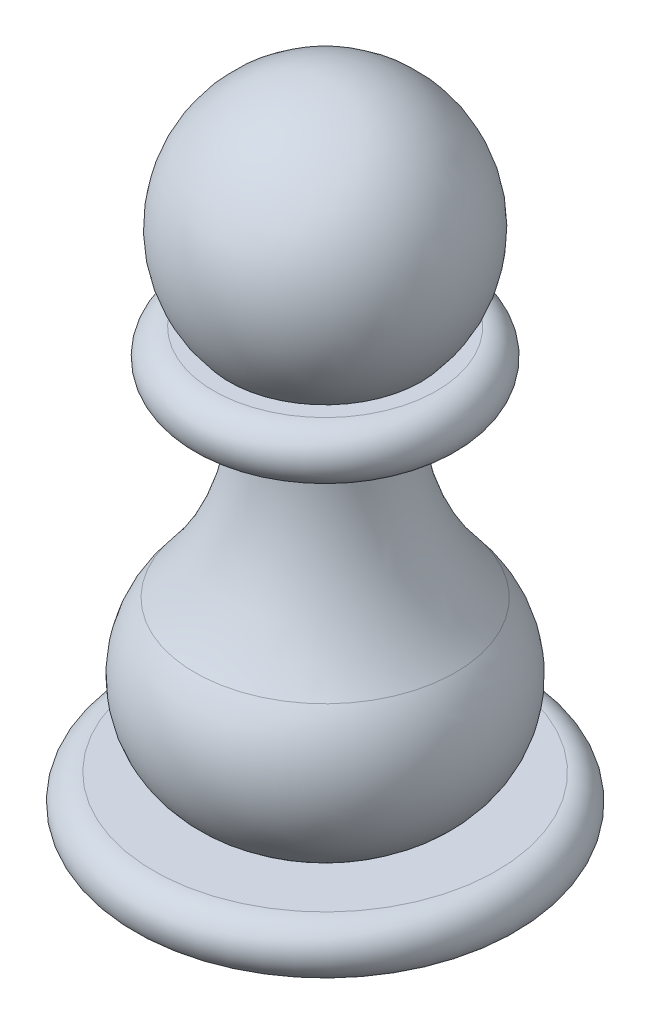
ISO-10303-21;
HEADER;
FILE_DESCRIPTION(('STEP AP214'),'2;1');
FILE_NAME('part.step','',(''),(''),'','','');
FILE_SCHEMA(('AUTOMOTIVE_DESIGN { 1 0 10303 214 1 1 1 1 }'));
ENDSEC;
DATA;
#1=APPLICATION_CONTEXT('core data for automotive mechanical design processes');
#2=APPLICATION_PROTOCOL_DEFINITION('international standard','automotive_design',2000,#1);
#3=PRODUCT_CONTEXT('',#1,'mechanical');
#4=PRODUCT('Part','Part','',(#3));
#5=PRODUCT_RELATED_PRODUCT_CATEGORY('part','',(#4));
#6=PRODUCT_DEFINITION_FORMATION('','',#4);
#7=PRODUCT_DEFINITION_CONTEXT('part definition',#1,'design');
#8=PRODUCT_DEFINITION('design','',#6,#7);
#9=PRODUCT_DEFINITION_SHAPE('','',#8);
#10=(LENGTH_UNIT() NAMED_UNIT(*) SI_UNIT(.MILLI.,.METRE.));
#11=(NAMED_UNIT(*) PLANE_ANGLE_UNIT() SI_UNIT($,.RADIAN.));
#12=(NAMED_UNIT(*) SI_UNIT($,.STERADIAN.) SOLID_ANGLE_UNIT());
#13=UNCERTAINTY_MEASURE_WITH_UNIT(LENGTH_MEASURE(1.E-05),#10,'distance_accuracy_value','');
#14=(GEOMETRIC_REPRESENTATION_CONTEXT(3) GLOBAL_UNCERTAINTY_ASSIGNED_CONTEXT((#13)) GLOBAL_UNIT_ASSIGNED_CONTEXT((#10,
#11,#12)) REPRESENTATION_CONTEXT('',''));
#15=CARTESIAN_POINT('',(0.,0.,0.));
#16=DIRECTION('',(0.,0.,1.));
#17=DIRECTION('',(1.,0.,0.));
#18=AXIS2_PLACEMENT_3D('',#15,#16,#17);
#19=CARTESIAN_POINT('',(0.,0.,0.));
#20=DIRECTION('',(0.,-1.,0.));
#21=DIRECTION('',(0.,0.,-1.));
#22=AXIS2_PLACEMENT_3D('',#19,#20,#21);
#23=PLANE('',#22);
#24=CARTESIAN_POINT('',(0.,0.,0.));
#25=DIRECTION('',(0.,-1.,0.));
#26=DIRECTION('',(0.,0.,-1.));
#27=AXIS2_PLACEMENT_3D('',#24,#25,#26);
#28=CIRCLE('',#27,10.);
#29=CARTESIAN_POINT('',(0.,0.,-10.));
#30=VERTEX_POINT('',#29);
#31=EDGE_CURVE('E80',#30,#30,#28,.T.);
#32=ORIENTED_EDGE('',*,*,#31,.T.);
#33=EDGE_LOOP('',(#32));
#34=FACE_BOUND('',#33,.T.);
#35=ADVANCED_FACE('F45',(#34),#23,.T.);
#36=CARTESIAN_POINT('',(0.,30.5,0.));
#37=DIRECTION('',(0.,-1.,0.));
#38=DIRECTION('',(1.,0.,0.));
#39=AXIS2_PLACEMENT_3D('',#36,#37,#38);
#40=SPHERICAL_SURFACE('',#39,7.5);
#41=CARTESIAN_POINT('',(0.,25.5,0.));
#42=DIRECTION('',(0.,-1.,0.));
#43=DIRECTION('',(0.,0.,-1.));
#44=AXIS2_PLACEMENT_3D('',#41,#42,#43);
#45=CIRCLE('',#44,5.59016994374947);
#46=CARTESIAN_POINT('',(0.,25.5,-5.59016994374947));
#47=VERTEX_POINT('',#46);
#48=EDGE_CURVE('E10',#47,#47,#45,.T.);
#49=ORIENTED_EDGE('',*,*,#48,.F.);
#50=EDGE_LOOP('',(#49));
#51=FACE_BOUND('',#50,.T.);
#52=ADVANCED_FACE('F98',(#51),#40,.T.);
#53=CARTESIAN_POINT('',(0.,25.5,0.));
#54=DIRECTION('',(0.,-1.,0.));
#55=DIRECTION('',(0.,0.,-1.));
#56=AXIS2_PLACEMENT_3D('',#53,#54,#55);
#57=PLANE('',#56);
#58=CARTESIAN_POINT('',(0.,25.5,0.));
#59=DIRECTION('',(0.,-1.,0.));
#60=DIRECTION('',(0.,0.,-1.));
#61=AXIS2_PLACEMENT_3D('',#58,#59,#60);
#62=CIRCLE('',#61,6.5);
#63=CARTESIAN_POINT('',(0.,25.5,-6.5));
#64=VERTEX_POINT('',#63);
#65=EDGE_CURVE('E52',#64,#64,#62,.T.);
#66=ORIENTED_EDGE('',*,*,#65,.F.);
#67=EDGE_LOOP('',(#66));
#68=FACE_BOUND('',#67,.T.);
#69=ORIENTED_EDGE('',*,*,#48,.T.);
#70=EDGE_LOOP('',(#69));
#71=FACE_BOUND('',#70,.T.);
#72=ADVANCED_FACE('F102',(#68,#71),#57,.F.);
#73=CARTESIAN_POINT('',(0.,24.,0.));
#74=DIRECTION('',(0.,-1.,0.));
#75=DIRECTION('',(0.,0.,-1.));
#76=AXIS2_PLACEMENT_3D('',#73,#74,#75);
#77=TOROIDAL_SURFACE('',#76,6.5,1.5);
#78=CARTESIAN_POINT('',(0.,22.5,0.));
#79=DIRECTION('',(0.,-1.,0.));
#80=DIRECTION('',(0.,0.,-1.));
#81=AXIS2_PLACEMENT_3D('',#78,#79,#80);
#82=CIRCLE('',#81,6.5);
#83=CARTESIAN_POINT('',(0.,22.5,-6.5));
#84=VERTEX_POINT('',#83);
#85=EDGE_CURVE('E57',#84,#84,#82,.T.);
#86=ORIENTED_EDGE('',*,*,#85,.F.);
#87=EDGE_LOOP('',(#86));
#88=FACE_BOUND('',#87,.T.);
#89=ORIENTED_EDGE('',*,*,#65,.T.);
#90=EDGE_LOOP('',(#89));
#91=FACE_BOUND('',#90,.T.);
#92=ADVANCED_FACE('F107',(#88,#91),#77,.T.);
#93=CARTESIAN_POINT('',(0.,22.5,0.));
#94=DIRECTION('',(0.,1.,0.));
#95=DIRECTION('',(0.,0.,1.));
#96=AXIS2_PLACEMENT_3D('',#93,#94,#95);
#97=PLANE('',#96);
#98=CARTESIAN_POINT('',(0.,22.5,0.));
#99=DIRECTION('',(0.,-1.,0.));
#100=DIRECTION('',(0.,0.,-1.));
#101=AXIS2_PLACEMENT_3D('',#98,#99,#100);
#102=CIRCLE('',#101,4.);
#103=CARTESIAN_POINT('',(0.,22.5,-4.));
#104=VERTEX_POINT('',#103);
#105=EDGE_CURVE('E62',#104,#104,#102,.T.);
#106=ORIENTED_EDGE('',*,*,#105,.F.);
#107=EDGE_LOOP('',(#106));
#108=FACE_BOUND('',#107,.T.);
#109=ORIENTED_EDGE('',*,*,#85,.T.);
#110=EDGE_LOOP('',(#109));
#111=FACE_BOUND('',#110,.T.);
#112=ADVANCED_FACE('F113',(#108,#111),#97,.F.);
#113=CARTESIAN_POINT('',(0.,21.5932239594175,0.));
#114=DIRECTION('',(0.,-1.,0.));
#115=DIRECTION('',(0.,0.,-1.));
#116=AXIS2_PLACEMENT_3D('',#113,#114,#115);
#117=TOROIDAL_SURFACE('',#116,18.9725668210974,15.);
#118=ORIENTED_EDGE('',*,*,#105,.T.);
#119=EDGE_LOOP('',(#118));
#120=FACE_BOUND('',#119,.T.);
#121=CARTESIAN_POINT('',(0.,11.8166399684698,0.));
#122=DIRECTION('',(0.,-1.,0.));
#123=DIRECTION('',(0.,0.,-1.));
#124=AXIS2_PLACEMENT_3D('',#121,#122,#123);
#125=CIRCLE('',#124,7.59634576716452);
#126=CARTESIAN_POINT('',(0.,11.8166399684698,-7.59634576716452));
#127=VERTEX_POINT('',#126);
#128=EDGE_CURVE('E68',#127,#127,#125,.T.);
#129=ORIENTED_EDGE('',*,*,#128,.F.);
#130=EDGE_LOOP('',(#129));
#131=FACE_BOUND('',#130,.T.);
#132=ADVANCED_FACE('F117',(#120,#131),#117,.F.);
#133=CARTESIAN_POINT('',(0.,7.90600637209075,0.));
#134=DIRECTION('',(0.,-1.,0.));
#135=DIRECTION('',(0.,0.,-1.));
#136=AXIS2_PLACEMENT_3D('',#133,#134,#135);
#137=DEGENERATE_TOROIDAL_SURFACE('',#136,3.04585734559138,6.,.T.);
#138=CARTESIAN_POINT('',(0.,3.,0.));
#139=DIRECTION('',(0.,-1.,0.));
#140=DIRECTION('',(0.,0.,-1.));
#141=AXIS2_PLACEMENT_3D('',#138,#139,#140);
#142=CIRCLE('',#141,6.5);
#143=CARTESIAN_POINT('',(0.,3.,-6.5));
#144=VERTEX_POINT('',#143);
#145=EDGE_CURVE('E72',#144,#144,#142,.T.);
#146=ORIENTED_EDGE('',*,*,#145,.F.);
#147=EDGE_LOOP('',(#146));
#148=FACE_BOUND('',#147,.T.);
#149=ORIENTED_EDGE('',*,*,#128,.T.);
#150=EDGE_LOOP('',(#149));
#151=FACE_BOUND('',#150,.T.);
#152=ADVANCED_FACE('F94',(#148,#151),#137,.T.);
#153=CARTESIAN_POINT('',(0.,3.,0.));
#154=DIRECTION('',(0.,1.,0.));
#155=DIRECTION('',(0.,0.,1.));
#156=AXIS2_PLACEMENT_3D('',#153,#154,#155);
#157=PLANE('',#156);
#158=ORIENTED_EDGE('',*,*,#145,.T.);
#159=EDGE_LOOP('',(#158));
#160=FACE_BOUND('',#159,.T.);
#161=CARTESIAN_POINT('',(0.,3.,0.));
#162=DIRECTION('',(0.,-1.,0.));
#163=DIRECTION('',(0.,0.,-1.));
#164=AXIS2_PLACEMENT_3D('',#161,#162,#163);
#165=CIRCLE('',#164,10.);
#166=CARTESIAN_POINT('',(0.,3.,-10.));
#167=VERTEX_POINT('',#166);
#168=EDGE_CURVE('E76',#167,#167,#165,.T.);
#169=ORIENTED_EDGE('',*,*,#168,.F.);
#170=EDGE_LOOP('',(#169));
#171=FACE_BOUND('',#170,.T.);
#172=ADVANCED_FACE('F88',(#160,#171),#157,.T.);
#173=CARTESIAN_POINT('',(0.,1.5,0.));
#174=DIRECTION('',(0.,-1.,0.));
#175=DIRECTION('',(0.,0.,-1.));
#176=AXIS2_PLACEMENT_3D('',#173,#174,#175);
#177=TOROIDAL_SURFACE('',#176,10.,1.5);
#178=ORIENTED_EDGE('',*,*,#168,.T.);
#179=EDGE_LOOP('',(#178));
#180=FACE_BOUND('',#179,.T.);
#181=ORIENTED_EDGE('',*,*,#31,.F.);
#182=EDGE_LOOP('',(#181));
#183=FACE_BOUND('',#182,.T.);
#184=ADVANCED_FACE('F86',(#180,#183),#177,.T.);
#185=CLOSED_SHELL('',(#35,#52,#72,#92,#112,#132,#152,#172,#184));
#186=MANIFOLD_SOLID_BREP('B2',#185);
#187=ADVANCED_BREP_SHAPE_REPRESENTATION('',(#18,#186),#14);
#188=SHAPE_DEFINITION_REPRESENTATION(#9,#187);
ENDSEC;
END-ISO-10303-21;
